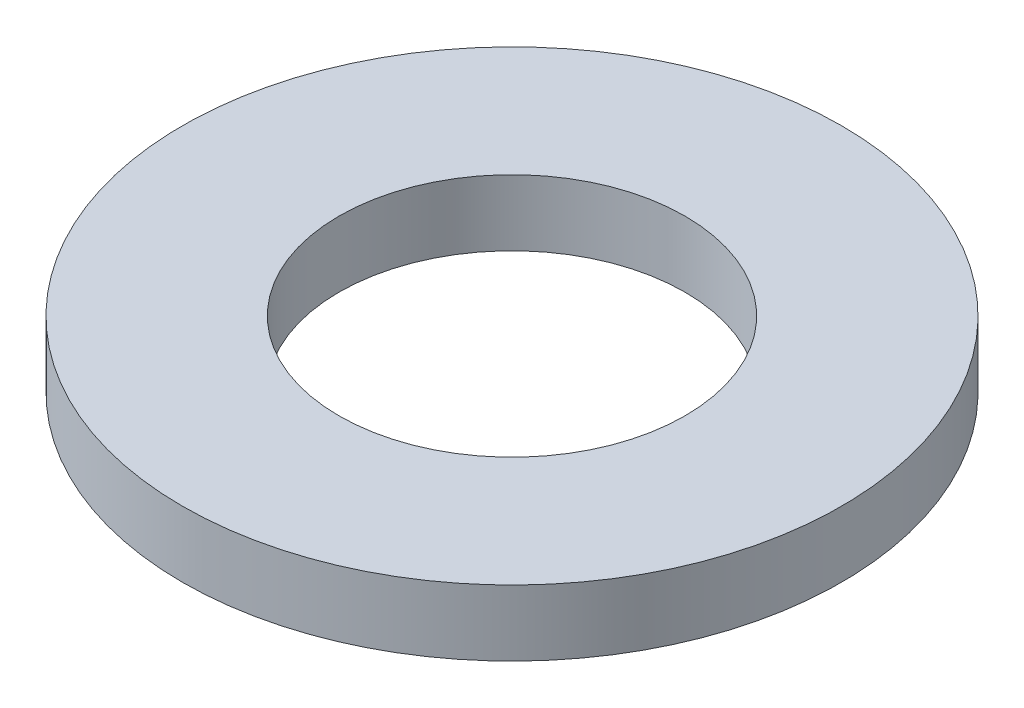
ISO-10303-21;
HEADER;
FILE_DESCRIPTION(('STEP AP214'),'2;1');
FILE_NAME('part.step','',(''),(''),'','','');
FILE_SCHEMA(('AUTOMOTIVE_DESIGN { 1 0 10303 214 1 1 1 1 }'));
ENDSEC;
DATA;
#1=APPLICATION_CONTEXT('core data for automotive mechanical design processes');
#2=APPLICATION_PROTOCOL_DEFINITION('international standard','automotive_design',2000,#1);
#3=PRODUCT_CONTEXT('',#1,'mechanical');
#4=PRODUCT('Part','Part','',(#3));
#5=PRODUCT_RELATED_PRODUCT_CATEGORY('part','',(#4));
#6=PRODUCT_DEFINITION_FORMATION('','',#4);
#7=PRODUCT_DEFINITION_CONTEXT('part definition',#1,'design');
#8=PRODUCT_DEFINITION('design','',#6,#7);
#9=PRODUCT_DEFINITION_SHAPE('','',#8);
#10=(LENGTH_UNIT() NAMED_UNIT(*) SI_UNIT(.MILLI.,.METRE.));
#11=(NAMED_UNIT(*) PLANE_ANGLE_UNIT() SI_UNIT($,.RADIAN.));
#12=(NAMED_UNIT(*) SI_UNIT($,.STERADIAN.) SOLID_ANGLE_UNIT());
#13=UNCERTAINTY_MEASURE_WITH_UNIT(LENGTH_MEASURE(1.E-05),#10,'distance_accuracy_value','');
#14=(GEOMETRIC_REPRESENTATION_CONTEXT(3) GLOBAL_UNCERTAINTY_ASSIGNED_CONTEXT((#13)) GLOBAL_UNIT_ASSIGNED_CONTEXT((#10,
#11,#12)) REPRESENTATION_CONTEXT('',''));
#15=CARTESIAN_POINT('',(0.,0.,0.));
#16=DIRECTION('',(0.,0.,1.));
#17=DIRECTION('',(1.,0.,0.));
#18=AXIS2_PLACEMENT_3D('',#15,#16,#17);
#19=CARTESIAN_POINT('',(0.,2.,0.));
#20=DIRECTION('',(0.,1.,0.));
#21=DIRECTION('',(0.,0.,1.));
#22=AXIS2_PLACEMENT_3D('',#19,#20,#21);
#23=PLANE('',#22);
#24=CARTESIAN_POINT('',(0.,2.,0.));
#25=DIRECTION('',(0.,1.,0.));
#26=DIRECTION('',(0.,0.,1.));
#27=AXIS2_PLACEMENT_3D('',#24,#25,#26);
#28=CIRCLE('',#27,10.);
#29=CARTESIAN_POINT('',(0.,2.,10.));
#30=VERTEX_POINT('',#29);
#31=EDGE_CURVE('E10',#30,#30,#28,.T.);
#32=ORIENTED_EDGE('',*,*,#31,.T.);
#33=EDGE_LOOP('',(#32));
#34=FACE_BOUND('',#33,.T.);
#35=CARTESIAN_POINT('',(0.,2.,0.));
#36=DIRECTION('',(0.,1.,0.));
#37=DIRECTION('',(0.,0.,1.));
#38=AXIS2_PLACEMENT_3D('',#35,#36,#37);
#39=CIRCLE('',#38,5.25);
#40=CARTESIAN_POINT('',(0.,2.,5.25));
#41=VERTEX_POINT('',#40);
#42=EDGE_CURVE('E40',#41,#41,#39,.T.);
#43=ORIENTED_EDGE('',*,*,#42,.F.);
#44=EDGE_LOOP('',(#43));
#45=FACE_BOUND('',#44,.T.);
#46=ADVANCED_FACE('F29',(#34,#45),#23,.T.);
#47=CARTESIAN_POINT('',(0.,0.,0.));
#48=DIRECTION('',(0.,1.,0.));
#49=DIRECTION('',(0.,0.,1.));
#50=AXIS2_PLACEMENT_3D('',#47,#48,#49);
#51=PLANE('',#50);
#52=CARTESIAN_POINT('',(0.,0.,0.));
#53=DIRECTION('',(0.,1.,0.));
#54=DIRECTION('',(0.,0.,1.));
#55=AXIS2_PLACEMENT_3D('',#52,#53,#54);
#56=CIRCLE('',#55,10.);
#57=CARTESIAN_POINT('',(0.,0.,10.));
#58=VERTEX_POINT('',#57);
#59=EDGE_CURVE('E33',#58,#58,#56,.T.);
#60=ORIENTED_EDGE('',*,*,#59,.F.);
#61=EDGE_LOOP('',(#60));
#62=FACE_BOUND('',#61,.T.);
#63=CARTESIAN_POINT('',(0.,0.,0.));
#64=DIRECTION('',(0.,1.,0.));
#65=DIRECTION('',(0.,0.,1.));
#66=AXIS2_PLACEMENT_3D('',#63,#64,#65);
#67=CIRCLE('',#66,5.25);
#68=CARTESIAN_POINT('',(0.,0.,5.25));
#69=VERTEX_POINT('',#68);
#70=EDGE_CURVE('E42',#69,#69,#67,.T.);
#71=ORIENTED_EDGE('',*,*,#70,.T.);
#72=EDGE_LOOP('',(#71));
#73=FACE_BOUND('',#72,.T.);
#74=ADVANCED_FACE('F52',(#62,#73),#51,.F.);
#75=CARTESIAN_POINT('',(0.,2.,0.));
#76=DIRECTION('',(0.,-1.,0.));
#77=DIRECTION('',(0.,0.,-1.));
#78=AXIS2_PLACEMENT_3D('',#75,#76,#77);
#79=CYLINDRICAL_SURFACE('',#78,10.);
#80=ORIENTED_EDGE('',*,*,#31,.F.);
#81=EDGE_LOOP('',(#80));
#82=FACE_BOUND('',#81,.T.);
#83=ORIENTED_EDGE('',*,*,#59,.T.);
#84=EDGE_LOOP('',(#83));
#85=FACE_BOUND('',#84,.T.);
#86=ADVANCED_FACE('F31',(#82,#85),#79,.T.);
#87=CARTESIAN_POINT('',(0.,2.,0.));
#88=DIRECTION('',(0.,-1.,0.));
#89=DIRECTION('',(0.,0.,-1.));
#90=AXIS2_PLACEMENT_3D('',#87,#88,#89);
#91=CYLINDRICAL_SURFACE('',#90,5.25);
#92=ORIENTED_EDGE('',*,*,#42,.T.);
#93=EDGE_LOOP('',(#92));
#94=FACE_BOUND('',#93,.T.);
#95=ORIENTED_EDGE('',*,*,#70,.F.);
#96=EDGE_LOOP('',(#95));
#97=FACE_BOUND('',#96,.T.);
#98=ADVANCED_FACE('F48',(#94,#97),#91,.F.);
#99=CLOSED_SHELL('',(#46,#74,#86,#98));
#100=MANIFOLD_SOLID_BREP('B2',#99);
#101=ADVANCED_BREP_SHAPE_REPRESENTATION('',(#18,#100),#14);
#102=SHAPE_DEFINITION_REPRESENTATION(#9,#101);
ENDSEC;
END-ISO-10303-21;
